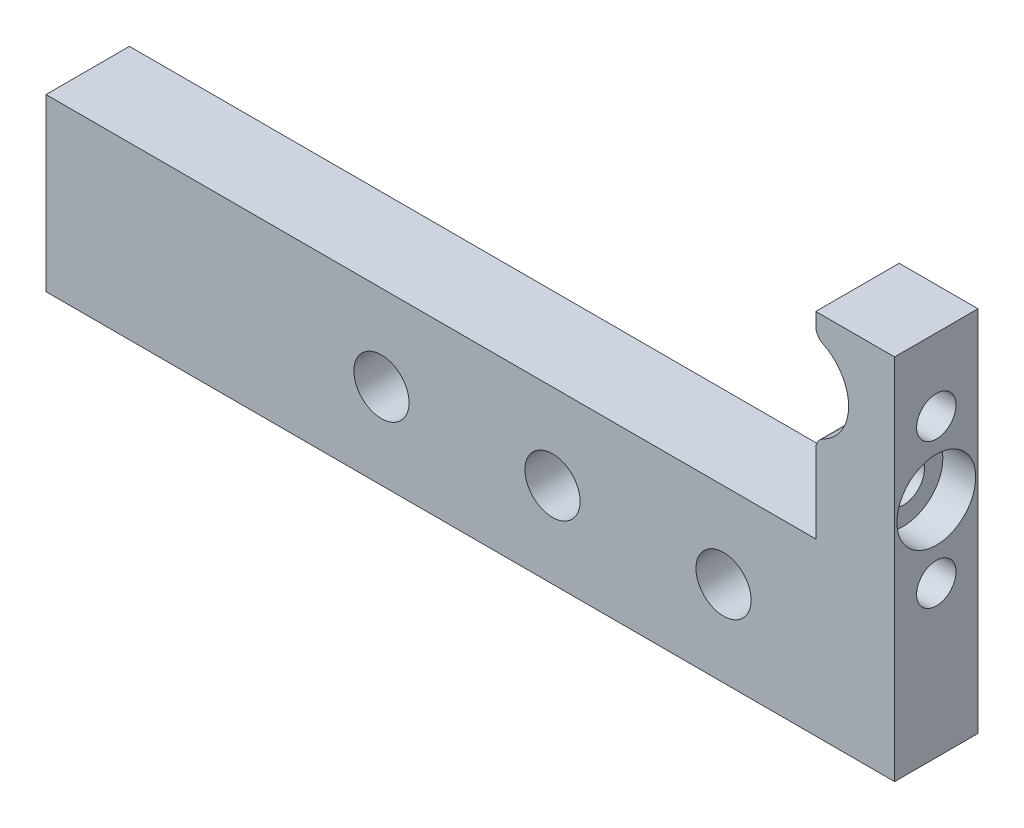
ISO-10303-21;
HEADER;
FILE_DESCRIPTION(('STEP AP214'),'2;1');
FILE_NAME('part.step','',(''),(''),'','','');
FILE_SCHEMA(('AUTOMOTIVE_DESIGN { 1 0 10303 214 1 1 1 1 }'));
ENDSEC;
DATA;
#1=APPLICATION_CONTEXT('core data for automotive mechanical design processes');
#2=APPLICATION_PROTOCOL_DEFINITION('international standard','automotive_design',2000,#1);
#3=PRODUCT_CONTEXT('',#1,'mechanical');
#4=PRODUCT('Part','Part','',(#3));
#5=PRODUCT_RELATED_PRODUCT_CATEGORY('part','',(#4));
#6=PRODUCT_DEFINITION_FORMATION('','',#4);
#7=PRODUCT_DEFINITION_CONTEXT('part definition',#1,'design');
#8=PRODUCT_DEFINITION('design','',#6,#7);
#9=PRODUCT_DEFINITION_SHAPE('','',#8);
#10=(LENGTH_UNIT() NAMED_UNIT(*) SI_UNIT(.MILLI.,.METRE.));
#11=(NAMED_UNIT(*) PLANE_ANGLE_UNIT() SI_UNIT($,.RADIAN.));
#12=(NAMED_UNIT(*) SI_UNIT($,.STERADIAN.) SOLID_ANGLE_UNIT());
#13=UNCERTAINTY_MEASURE_WITH_UNIT(LENGTH_MEASURE(1.E-05),#10,'distance_accuracy_value','');
#14=(GEOMETRIC_REPRESENTATION_CONTEXT(3) GLOBAL_UNCERTAINTY_ASSIGNED_CONTEXT((#13)) GLOBAL_UNIT_ASSIGNED_CONTEXT((#10,
#11,#12)) REPRESENTATION_CONTEXT('',''));
#15=CARTESIAN_POINT('',(0.,0.,0.));
#16=DIRECTION('',(0.,0.,1.));
#17=DIRECTION('',(1.,0.,0.));
#18=AXIS2_PLACEMENT_3D('',#15,#16,#17);
#19=CARTESIAN_POINT('',(45.4,-12.,3.17500000000004));
#20=DIRECTION('',(1.,0.,0.));
#21=DIRECTION('',(0.,0.,-1.));
#22=AXIS2_PLACEMENT_3D('',#19,#20,#21);
#23=CYLINDRICAL_SURFACE('',#22,1.6);
#24=CARTESIAN_POINT('',(104.,-12.,3.17500000000004));
#25=DIRECTION('',(1.,0.,0.));
#26=DIRECTION('',(0.,0.,-1.));
#27=AXIS2_PLACEMENT_3D('',#24,#25,#26);
#28=CIRCLE('',#27,1.6);
#29=CARTESIAN_POINT('',(104.,-12.,1.57500000000004));
#30=VERTEX_POINT('',#29);
#31=EDGE_CURVE('E142',#30,#30,#28,.T.);
#32=ORIENTED_EDGE('',*,*,#31,.F.);
#33=EDGE_LOOP('',(#32));
#34=FACE_BOUND('',#33,.T.);
#35=CARTESIAN_POINT('',(107.5,-12.,3.17500000000004));
#36=DIRECTION('',(1.,0.,0.));
#37=DIRECTION('',(0.,0.,-1.));
#38=AXIS2_PLACEMENT_3D('',#35,#36,#37);
#39=CIRCLE('',#38,1.6);
#40=CARTESIAN_POINT('',(107.5,-12.,1.57500000000004));
#41=VERTEX_POINT('',#40);
#42=EDGE_CURVE('E146',#41,#41,#39,.F.);
#43=ORIENTED_EDGE('',*,*,#42,.F.);
#44=EDGE_LOOP('',(#43));
#45=FACE_BOUND('',#44,.T.);
#46=ADVANCED_FACE('F31',(#34,#45),#23,.F.);
#47=CARTESIAN_POINT('',(103.,-5.99999999999999,6.35));
#48=DIRECTION('',(0.,0.,1.));
#49=DIRECTION('',(1.,0.,0.));
#50=AXIS2_PLACEMENT_3D('',#47,#48,#49);
#51=PLANE('',#50);
#52=CARTESIAN_POINT('',(83.9572529445862,-22.5,6.35));
#53=DIRECTION('',(0.,0.,1.));
#54=DIRECTION('',(1.,0.,0.));
#55=AXIS2_PLACEMENT_3D('',#52,#53,#54);
#56=CIRCLE('',#55,2.10000000000002);
#57=CARTESIAN_POINT('',(86.0572529445862,-22.5,6.35));
#58=VERTEX_POINT('',#57);
#59=EDGE_CURVE('E288',#58,#58,#56,.T.);
#60=ORIENTED_EDGE('',*,*,#59,.F.);
#61=EDGE_LOOP('',(#60));
#62=FACE_BOUND('',#61,.T.);
#63=DIRECTION('',(0.,-1.,0.));
#64=VECTOR('',#63,1.);
#65=CARTESIAN_POINT('',(104.,-1.,6.35));
#66=LINE('',#65,#64);
#67=CARTESIAN_POINT('',(104.,-1.,6.35));
#68=VERTEX_POINT('',#67);
#69=CARTESIAN_POINT('',(104.,-1.96887112585072,6.35));
#70=VERTEX_POINT('',#69);
#71=EDGE_CURVE('E237',#68,#70,#66,.T.);
#72=ORIENTED_EDGE('',*,*,#71,.T.);
#73=CARTESIAN_POINT('',(105.,-1.96887112585072,6.35));
#74=DIRECTION('',(0.,0.,1.));
#75=DIRECTION('',(1.,0.,0.));
#76=AXIS2_PLACEMENT_3D('',#73,#74,#75);
#77=CIRCLE('',#76,1.);
#78=CARTESIAN_POINT('',(104.555555555556,-2.86467754232833,6.35));
#79=VERTEX_POINT('',#78);
#80=EDGE_CURVE('E39',#70,#79,#77,.T.);
#81=ORIENTED_EDGE('',*,*,#80,.T.);
#82=CARTESIAN_POINT('',(103.,-5.99999999999999,6.35));
#83=DIRECTION('',(0.,0.,-1.));
#84=DIRECTION('',(1.,0.,0.));
#85=AXIS2_PLACEMENT_3D('',#82,#83,#84);
#86=CIRCLE('',#85,3.50000000000001);
#87=CARTESIAN_POINT('',(104.555555555556,-9.13532245767165,6.35));
#88=VERTEX_POINT('',#87);
#89=EDGE_CURVE('E221',#79,#88,#86,.T.);
#90=ORIENTED_EDGE('',*,*,#89,.T.);
#91=CARTESIAN_POINT('',(105.,-10.0311288741493,6.35));
#92=DIRECTION('',(0.,0.,1.));
#93=DIRECTION('',(1.,0.,0.));
#94=AXIS2_PLACEMENT_3D('',#91,#92,#93);
#95=CIRCLE('',#94,1.);
#96=CARTESIAN_POINT('',(104.,-10.0311288741493,6.35));
#97=VERTEX_POINT('',#96);
#98=EDGE_CURVE('E46',#88,#97,#95,.T.);
#99=ORIENTED_EDGE('',*,*,#98,.T.);
#100=DIRECTION('',(0.,-1.,0.));
#101=VECTOR('',#100,1.);
#102=CARTESIAN_POINT('',(104.,-9.35410196624968,6.35));
#103=LINE('',#102,#101);
#104=CARTESIAN_POINT('',(104.,-16.,6.35));
#105=VERTEX_POINT('',#104);
#106=EDGE_CURVE('E125',#97,#105,#103,.T.);
#107=ORIENTED_EDGE('',*,*,#106,.T.);
#108=DIRECTION('',(-1.,0.,0.));
#109=VECTOR('',#108,1.);
#110=CARTESIAN_POINT('',(45.4,-16.,6.35));
#111=LINE('',#110,#109);
#112=CARTESIAN_POINT('',(45.4,-16.,6.35));
#113=VERTEX_POINT('',#112);
#114=EDGE_CURVE('E120',#105,#113,#111,.T.);
#115=ORIENTED_EDGE('',*,*,#114,.T.);
#116=DIRECTION('',(0.,-1.,0.));
#117=VECTOR('',#116,1.);
#118=CARTESIAN_POINT('',(45.4,-16.,6.35));
#119=LINE('',#118,#117);
#120=CARTESIAN_POINT('',(45.4,-29.,6.35));
#121=VERTEX_POINT('',#120);
#122=EDGE_CURVE('E111',#113,#121,#119,.T.);
#123=ORIENTED_EDGE('',*,*,#122,.T.);
#124=DIRECTION('',(1.,0.,0.));
#125=VECTOR('',#124,1.);
#126=CARTESIAN_POINT('',(45.4,-29.,6.35));
#127=LINE('',#126,#125);
#128=CARTESIAN_POINT('',(110.,-29.,6.35));
#129=VERTEX_POINT('',#128);
#130=EDGE_CURVE('E119',#121,#129,#127,.T.);
#131=ORIENTED_EDGE('',*,*,#130,.T.);
#132=DIRECTION('',(0.,1.,0.));
#133=VECTOR('',#132,1.);
#134=CARTESIAN_POINT('',(110.,-29.,6.35));
#135=LINE('',#134,#133);
#136=CARTESIAN_POINT('',(110.,-1.,6.35));
#137=VERTEX_POINT('',#136);
#138=EDGE_CURVE('E271',#129,#137,#135,.T.);
#139=ORIENTED_EDGE('',*,*,#138,.T.);
#140=DIRECTION('',(-1.,0.,0.));
#141=VECTOR('',#140,1.);
#142=CARTESIAN_POINT('',(104.,-1.,6.35));
#143=LINE('',#142,#141);
#144=EDGE_CURVE('E281',#137,#68,#143,.T.);
#145=ORIENTED_EDGE('',*,*,#144,.T.);
#146=EDGE_LOOP('',(#72,#81,#90,#99,#107,#115,#123,#131,#139,#145));
#147=FACE_BOUND('',#146,.T.);
#148=CARTESIAN_POINT('',(96.9786264722931,-22.5,6.35));
#149=DIRECTION('',(0.,0.,1.));
#150=DIRECTION('',(1.,0.,0.));
#151=AXIS2_PLACEMENT_3D('',#148,#149,#150);
#152=CIRCLE('',#151,2.10000000000002);
#153=CARTESIAN_POINT('',(99.0786264722931,-22.5,6.35));
#154=VERTEX_POINT('',#153);
#155=EDGE_CURVE('E278',#154,#154,#152,.T.);
#156=ORIENTED_EDGE('',*,*,#155,.F.);
#157=EDGE_LOOP('',(#156));
#158=FACE_BOUND('',#157,.T.);
#159=CARTESIAN_POINT('',(70.9358794168792,-22.5,6.35));
#160=DIRECTION('',(0.,0.,1.));
#161=DIRECTION('',(1.,0.,0.));
#162=AXIS2_PLACEMENT_3D('',#159,#160,#161);
#163=CIRCLE('',#162,2.10000000000002);
#164=CARTESIAN_POINT('',(73.0358794168793,-22.5,6.35));
#165=VERTEX_POINT('',#164);
#166=EDGE_CURVE('E294',#165,#165,#163,.T.);
#167=ORIENTED_EDGE('',*,*,#166,.F.);
#168=EDGE_LOOP('',(#167));
#169=FACE_BOUND('',#168,.T.);
#170=ADVANCED_FACE('F123',(#62,#147,#158,#169),#51,.T.);
#171=CARTESIAN_POINT('',(103.,-5.99999999999999,0.));
#172=DIRECTION('',(0.,0.,1.));
#173=DIRECTION('',(1.,0.,0.));
#174=AXIS2_PLACEMENT_3D('',#171,#172,#173);
#175=PLANE('',#174);
#176=CARTESIAN_POINT('',(83.9572529445862,-22.5,0.));
#177=DIRECTION('',(0.,0.,1.));
#178=DIRECTION('',(1.,0.,0.));
#179=AXIS2_PLACEMENT_3D('',#176,#177,#178);
#180=CIRCLE('',#179,2.10000000000002);
#181=CARTESIAN_POINT('',(86.0572529445862,-22.5,0.));
#182=VERTEX_POINT('',#181);
#183=EDGE_CURVE('E291',#182,#182,#180,.T.);
#184=ORIENTED_EDGE('',*,*,#183,.T.);
#185=EDGE_LOOP('',(#184));
#186=FACE_BOUND('',#185,.T.);
#187=CARTESIAN_POINT('',(103.,-5.99999999999999,0.));
#188=DIRECTION('',(0.,0.,-1.));
#189=DIRECTION('',(1.,0.,0.));
#190=AXIS2_PLACEMENT_3D('',#187,#188,#189);
#191=CIRCLE('',#190,3.50000000000001);
#192=CARTESIAN_POINT('',(104.555555555556,-2.86467754232833,0.));
#193=VERTEX_POINT('',#192);
#194=CARTESIAN_POINT('',(104.555555555556,-9.13532245767165,0.));
#195=VERTEX_POINT('',#194);
#196=EDGE_CURVE('E246',#193,#195,#191,.T.);
#197=ORIENTED_EDGE('',*,*,#196,.F.);
#198=CARTESIAN_POINT('',(105.,-1.96887112585072,0.));
#199=DIRECTION('',(0.,0.,1.));
#200=DIRECTION('',(1.,0.,0.));
#201=AXIS2_PLACEMENT_3D('',#198,#199,#200);
#202=CIRCLE('',#201,1.);
#203=CARTESIAN_POINT('',(104.,-1.96887112585072,0.));
#204=VERTEX_POINT('',#203);
#205=EDGE_CURVE('E229',#193,#204,#202,.F.);
#206=ORIENTED_EDGE('',*,*,#205,.T.);
#207=DIRECTION('',(0.,-1.,0.));
#208=VECTOR('',#207,1.);
#209=CARTESIAN_POINT('',(104.,-1.,0.));
#210=LINE('',#209,#208);
#211=CARTESIAN_POINT('',(104.,-1.,0.));
#212=VERTEX_POINT('',#211);
#213=EDGE_CURVE('E245',#212,#204,#210,.T.);
#214=ORIENTED_EDGE('',*,*,#213,.F.);
#215=DIRECTION('',(-1.,0.,0.));
#216=VECTOR('',#215,1.);
#217=CARTESIAN_POINT('',(104.,-1.,0.));
#218=LINE('',#217,#216);
#219=CARTESIAN_POINT('',(110.,-1.,0.));
#220=VERTEX_POINT('',#219);
#221=EDGE_CURVE('E250',#220,#212,#218,.T.);
#222=ORIENTED_EDGE('',*,*,#221,.F.);
#223=DIRECTION('',(0.,1.,0.));
#224=VECTOR('',#223,1.);
#225=CARTESIAN_POINT('',(110.,-29.,0.));
#226=LINE('',#225,#224);
#227=CARTESIAN_POINT('',(110.,-29.,0.));
#228=VERTEX_POINT('',#227);
#229=EDGE_CURVE('E254',#228,#220,#226,.T.);
#230=ORIENTED_EDGE('',*,*,#229,.F.);
#231=DIRECTION('',(1.,0.,0.));
#232=VECTOR('',#231,1.);
#233=CARTESIAN_POINT('',(45.4,-29.,0.));
#234=LINE('',#233,#232);
#235=CARTESIAN_POINT('',(45.4,-29.,0.));
#236=VERTEX_POINT('',#235);
#237=EDGE_CURVE('E274',#236,#228,#234,.T.);
#238=ORIENTED_EDGE('',*,*,#237,.F.);
#239=DIRECTION('',(0.,-1.,0.));
#240=VECTOR('',#239,1.);
#241=CARTESIAN_POINT('',(45.4,-16.,0.));
#242=LINE('',#241,#240);
#243=CARTESIAN_POINT('',(45.4,-16.,0.));
#244=VERTEX_POINT('',#243);
#245=EDGE_CURVE('E275',#244,#236,#242,.T.);
#246=ORIENTED_EDGE('',*,*,#245,.F.);
#247=DIRECTION('',(-1.,0.,0.));
#248=VECTOR('',#247,1.);
#249=CARTESIAN_POINT('',(104.,-16.,0.));
#250=LINE('',#249,#248);
#251=CARTESIAN_POINT('',(104.,-16.,0.));
#252=VERTEX_POINT('',#251);
#253=EDGE_CURVE('E129',#252,#244,#250,.T.);
#254=ORIENTED_EDGE('',*,*,#253,.F.);
#255=DIRECTION('',(0.,-1.,0.));
#256=VECTOR('',#255,1.);
#257=CARTESIAN_POINT('',(104.,-9.35410196624968,0.));
#258=LINE('',#257,#256);
#259=CARTESIAN_POINT('',(104.,-10.0311288741493,0.));
#260=VERTEX_POINT('',#259);
#261=EDGE_CURVE('E252',#260,#252,#258,.T.);
#262=ORIENTED_EDGE('',*,*,#261,.F.);
#263=CARTESIAN_POINT('',(105.,-10.0311288741493,0.));
#264=DIRECTION('',(0.,0.,1.));
#265=DIRECTION('',(1.,0.,0.));
#266=AXIS2_PLACEMENT_3D('',#263,#264,#265);
#267=CIRCLE('',#266,1.);
#268=EDGE_CURVE('E225',#260,#195,#267,.F.);
#269=ORIENTED_EDGE('',*,*,#268,.T.);
#270=EDGE_LOOP('',(#197,#206,#214,#222,#230,#238,#246,#254,#262,#269));
#271=FACE_BOUND('',#270,.T.);
#272=CARTESIAN_POINT('',(96.9786264722931,-22.5,0.));
#273=DIRECTION('',(0.,0.,1.));
#274=DIRECTION('',(1.,0.,0.));
#275=AXIS2_PLACEMENT_3D('',#272,#273,#274);
#276=CIRCLE('',#275,2.10000000000002);
#277=CARTESIAN_POINT('',(99.0786264722931,-22.5,0.));
#278=VERTEX_POINT('',#277);
#279=EDGE_CURVE('E285',#278,#278,#276,.T.);
#280=ORIENTED_EDGE('',*,*,#279,.T.);
#281=EDGE_LOOP('',(#280));
#282=FACE_BOUND('',#281,.T.);
#283=CARTESIAN_POINT('',(70.9358794168792,-22.5,0.));
#284=DIRECTION('',(0.,0.,1.));
#285=DIRECTION('',(1.,0.,0.));
#286=AXIS2_PLACEMENT_3D('',#283,#284,#285);
#287=CIRCLE('',#286,2.10000000000002);
#288=CARTESIAN_POINT('',(73.0358794168793,-22.5,0.));
#289=VERTEX_POINT('',#288);
#290=EDGE_CURVE('E145',#289,#289,#287,.T.);
#291=ORIENTED_EDGE('',*,*,#290,.T.);
#292=EDGE_LOOP('',(#291));
#293=FACE_BOUND('',#292,.T.);
#294=ADVANCED_FACE('F202',(#186,#271,#282,#293),#175,.F.);
#295=CARTESIAN_POINT('',(45.4,-16.,6.35));
#296=DIRECTION('',(1.,0.,0.));
#297=DIRECTION('',(0.,1.,0.));
#298=AXIS2_PLACEMENT_3D('',#295,#296,#297);
#299=PLANE('',#298);
#300=ORIENTED_EDGE('',*,*,#245,.T.);
#301=DIRECTION('',(0.,0.,-1.));
#302=VECTOR('',#301,1.);
#303=CARTESIAN_POINT('',(45.4,-29.,6.35));
#304=LINE('',#303,#302);
#305=EDGE_CURVE('E117',#121,#236,#304,.T.);
#306=ORIENTED_EDGE('',*,*,#305,.F.);
#307=ORIENTED_EDGE('',*,*,#122,.F.);
#308=DIRECTION('',(0.,0.,-1.));
#309=VECTOR('',#308,1.);
#310=CARTESIAN_POINT('',(45.4,-16.,6.35));
#311=LINE('',#310,#309);
#312=EDGE_CURVE('E115',#113,#244,#311,.T.);
#313=ORIENTED_EDGE('',*,*,#312,.T.);
#314=EDGE_LOOP('',(#300,#306,#307,#313));
#315=FACE_BOUND('',#314,.T.);
#316=ADVANCED_FACE('F113',(#315),#299,.F.);
#317=CARTESIAN_POINT('',(45.4,-29.,6.35));
#318=DIRECTION('',(0.,1.,0.));
#319=DIRECTION('',(-1.,0.,0.));
#320=AXIS2_PLACEMENT_3D('',#317,#318,#319);
#321=PLANE('',#320);
#322=ORIENTED_EDGE('',*,*,#237,.T.);
#323=DIRECTION('',(0.,0.,-1.));
#324=VECTOR('',#323,1.);
#325=CARTESIAN_POINT('',(110.,-29.,6.35));
#326=LINE('',#325,#324);
#327=EDGE_CURVE('E138',#129,#228,#326,.T.);
#328=ORIENTED_EDGE('',*,*,#327,.F.);
#329=ORIENTED_EDGE('',*,*,#130,.F.);
#330=ORIENTED_EDGE('',*,*,#305,.T.);
#331=EDGE_LOOP('',(#322,#328,#329,#330));
#332=FACE_BOUND('',#331,.T.);
#333=ADVANCED_FACE('F318',(#332),#321,.F.);
#334=CARTESIAN_POINT('',(110.,-29.,6.35));
#335=DIRECTION('',(-1.,0.,0.));
#336=DIRECTION('',(0.,0.,1.));
#337=AXIS2_PLACEMENT_3D('',#334,#335,#336);
#338=PLANE('',#337);
#339=CARTESIAN_POINT('',(110.,-6.50000000000003,3.17500000000004));
#340=DIRECTION('',(1.,0.,0.));
#341=DIRECTION('',(0.,0.,-1.));
#342=AXIS2_PLACEMENT_3D('',#339,#340,#341);
#343=CIRCLE('',#342,1.5);
#344=CARTESIAN_POINT('',(110.,-6.50000000000003,1.67500000000004));
#345=VERTEX_POINT('',#344);
#346=EDGE_CURVE('E157',#345,#345,#343,.T.);
#347=ORIENTED_EDGE('',*,*,#346,.F.);
#348=EDGE_LOOP('',(#347));
#349=FACE_BOUND('',#348,.T.);
#350=CARTESIAN_POINT('',(110.,-17.5,3.17500000000004));
#351=DIRECTION('',(1.,0.,0.));
#352=DIRECTION('',(0.,0.,-1.));
#353=AXIS2_PLACEMENT_3D('',#350,#351,#352);
#354=CIRCLE('',#353,1.5);
#355=CARTESIAN_POINT('',(110.,-17.5,1.67500000000004));
#356=VERTEX_POINT('',#355);
#357=EDGE_CURVE('E156',#356,#356,#354,.T.);
#358=ORIENTED_EDGE('',*,*,#357,.F.);
#359=EDGE_LOOP('',(#358));
#360=FACE_BOUND('',#359,.T.);
#361=CARTESIAN_POINT('',(110.,-12.,3.17500000000004));
#362=DIRECTION('',(1.,0.,0.));
#363=DIRECTION('',(0.,0.,-1.));
#364=AXIS2_PLACEMENT_3D('',#361,#362,#363);
#365=CIRCLE('',#364,3.);
#366=CARTESIAN_POINT('',(110.,-12.,0.175000000000038));
#367=VERTEX_POINT('',#366);
#368=EDGE_CURVE('E301',#367,#367,#365,.T.);
#369=ORIENTED_EDGE('',*,*,#368,.F.);
#370=EDGE_LOOP('',(#369));
#371=FACE_BOUND('',#370,.T.);
#372=ORIENTED_EDGE('',*,*,#229,.T.);
#373=DIRECTION('',(0.,0.,-1.));
#374=VECTOR('',#373,1.);
#375=CARTESIAN_POINT('',(110.,-1.,6.35));
#376=LINE('',#375,#374);
#377=EDGE_CURVE('E262',#137,#220,#376,.T.);
#378=ORIENTED_EDGE('',*,*,#377,.F.);
#379=ORIENTED_EDGE('',*,*,#138,.F.);
#380=ORIENTED_EDGE('',*,*,#327,.T.);
#381=EDGE_LOOP('',(#372,#378,#379,#380));
#382=FACE_BOUND('',#381,.T.);
#383=ADVANCED_FACE('F269',(#349,#360,#371,#382),#338,.F.);
#384=CARTESIAN_POINT('',(104.,-1.,6.35));
#385=DIRECTION('',(0.,-1.,0.));
#386=DIRECTION('',(0.,0.,-1.));
#387=AXIS2_PLACEMENT_3D('',#384,#385,#386);
#388=PLANE('',#387);
#389=ORIENTED_EDGE('',*,*,#221,.T.);
#390=DIRECTION('',(0.,0.,-1.));
#391=VECTOR('',#390,1.);
#392=CARTESIAN_POINT('',(104.,-1.,6.35));
#393=LINE('',#392,#391);
#394=EDGE_CURVE('E249',#68,#212,#393,.T.);
#395=ORIENTED_EDGE('',*,*,#394,.F.);
#396=ORIENTED_EDGE('',*,*,#144,.F.);
#397=ORIENTED_EDGE('',*,*,#377,.T.);
#398=EDGE_LOOP('',(#389,#395,#396,#397));
#399=FACE_BOUND('',#398,.T.);
#400=ADVANCED_FACE('F317',(#399),#388,.F.);
#401=CARTESIAN_POINT('',(104.,-1.,6.35));
#402=DIRECTION('',(1.,0.,0.));
#403=DIRECTION('',(0.,0.,-1.));
#404=AXIS2_PLACEMENT_3D('',#401,#402,#403);
#405=PLANE('',#404);
#406=ORIENTED_EDGE('',*,*,#213,.T.);
#407=DIRECTION('',(0.,0.,-1.));
#408=VECTOR('',#407,1.);
#409=CARTESIAN_POINT('',(104.,-1.96887112585072,6.35));
#410=LINE('',#409,#408);
#411=EDGE_CURVE('E54',#204,#70,#410,.F.);
#412=ORIENTED_EDGE('',*,*,#411,.T.);
#413=ORIENTED_EDGE('',*,*,#71,.F.);
#414=ORIENTED_EDGE('',*,*,#394,.T.);
#415=EDGE_LOOP('',(#406,#412,#413,#414));
#416=FACE_BOUND('',#415,.T.);
#417=ADVANCED_FACE('F214',(#416),#405,.F.);
#418=CARTESIAN_POINT('',(103.,-5.99999999999999,6.35));
#419=DIRECTION('',(0.,0.,-1.));
#420=DIRECTION('',(-1.,0.,0.));
#421=AXIS2_PLACEMENT_3D('',#418,#419,#420);
#422=CYLINDRICAL_SURFACE('',#421,3.50000000000001);
#423=CARTESIAN_POINT('',(106.464101615138,-6.50000000000003,1.67500000000004));
#424=CARTESIAN_POINT('',(106.475351789507,-6.42203163953584,1.67500442399997));
#425=CARTESIAN_POINT('',(106.483960698333,-6.34361066464195,1.68110797623919));
#426=CARTESIAN_POINT('',(106.49580507365,-6.18824439791959,1.70564374821259));
#427=CARTESIAN_POINT('',(106.499034299432,-6.11130092215626,1.72409025169792));
#428=CARTESIAN_POINT('',(106.500588724377,-5.9613457023056,1.77283846741956));
#429=CARTESIAN_POINT('',(106.498921095822,-5.88832836729727,1.80312278480571));
#430=CARTESIAN_POINT('',(106.491632074619,-5.74812470055011,1.87466095076449));
#431=CARTESIAN_POINT('',(106.486010653438,-5.68093841089616,1.91591487850025));
#432=CARTESIAN_POINT('',(106.471907465461,-5.5526559799953,2.00925231389555));
#433=CARTESIAN_POINT('',(106.463366360802,-5.49172334131479,2.06155110518755));
#434=CARTESIAN_POINT('',(106.444950582233,-5.37904815248939,2.17506630497793));
#435=CARTESIAN_POINT('',(106.435075481468,-5.32730855626905,2.23628556835883));
#436=CARTESIAN_POINT('',(106.41500277516,-5.23170742065451,2.36969176712607));
#437=CARTESIAN_POINT('',(106.40481624687,-5.18841665848731,2.4422906457822));
#438=CARTESIAN_POINT('',(106.386361081826,-5.1145534383478,2.59392485832169));
#439=CARTESIAN_POINT('',(106.378092326914,-5.08398019672778,2.67295979525915));
#440=CARTESIAN_POINT('',(106.364879917679,-5.03657167075351,2.83515036827173));
#441=CARTESIAN_POINT('',(106.359929287564,-5.01970754930664,2.91829696234376));
#442=CARTESIAN_POINT('',(106.354187845891,-5.00023408908483,3.08637397189814));
#443=CARTESIAN_POINT('',(106.35339582694,-4.99762061283708,3.17130386243606));
#444=CARTESIAN_POINT('',(106.356053374539,-5.00656079328712,3.33706656548875));
#445=CARTESIAN_POINT('',(106.359341704986,-5.01757586560268,3.41793174484971));
#446=CARTESIAN_POINT('',(106.36935206165,-5.05248107436314,3.57660969325911));
#447=CARTESIAN_POINT('',(106.37607448825,-5.07637271211611,3.65442210524334));
#448=CARTESIAN_POINT('',(106.391952896548,-5.13650522258937,3.80551076796083));
#449=CARTESIAN_POINT('',(106.401126493645,-5.17283604395372,3.87874925048498));
#450=CARTESIAN_POINT('',(106.420457999905,-5.25681845423218,4.01828791871969));
#451=CARTESIAN_POINT('',(106.430616171165,-5.30447306249725,4.08458624711854));
#452=CARTESIAN_POINT('',(106.45070171554,-5.41198966213606,4.21104146616473));
#453=CARTESIAN_POINT('',(106.460605120793,-5.47225121390631,4.2708633611805));
#454=CARTESIAN_POINT('',(106.477938518519,-5.60221533565046,4.37964113388111));
#455=CARTESIAN_POINT('',(106.485368754053,-5.67191697691764,4.42859807920048));
#456=CARTESIAN_POINT('',(106.496016617706,-5.81792682615717,4.51358815878952));
#457=CARTESIAN_POINT('',(106.4992864726,-5.89414004448778,4.5497773117206));
#458=CARTESIAN_POINT('',(106.500503097872,-6.0515830005276,4.60887006896856));
#459=CARTESIAN_POINT('',(106.498452404906,-6.13281032965255,4.63177999799781));
#460=CARTESIAN_POINT('',(106.488590610388,-6.29292557688367,4.6627475818383));
#461=CARTESIAN_POINT('',(106.481110921215,-6.37168705442324,4.67157003377651));
#462=CARTESIAN_POINT('',(106.460714168693,-6.52890409654936,4.67678249406023));
#463=CARTESIAN_POINT('',(106.447797248973,-6.60735966916141,4.67317283079279));
#464=CARTESIAN_POINT('',(106.417138617377,-6.76109052141801,4.65411533967038));
#465=CARTESIAN_POINT('',(106.399440376897,-6.83638771664883,4.63877199767477));
#466=CARTESIAN_POINT('',(106.360038832189,-6.98279914168798,4.59721706915249));
#467=CARTESIAN_POINT('',(106.338334600932,-7.05391239825458,4.57100296526097));
#468=CARTESIAN_POINT('',(106.290312773195,-7.19576831145642,4.50632726268804));
#469=CARTESIAN_POINT('',(106.263771144488,-7.26608221509391,4.46709384417909));
#470=CARTESIAN_POINT('',(106.208978563767,-7.39915909325202,4.37829618502259));
#471=CARTESIAN_POINT('',(106.180726187459,-7.46191564225693,4.32872324983707));
#472=CARTESIAN_POINT('',(106.121550078107,-7.58461587336127,4.21485176249638));
#473=CARTESIAN_POINT('',(106.090638440429,-7.64366778833063,4.14958181427433));
#474=CARTESIAN_POINT('',(106.031721198218,-7.74996042601031,4.00888272357512));
#475=CARTESIAN_POINT('',(106.003713860649,-7.79720821640503,3.93345970205426));
#476=CARTESIAN_POINT('',(105.958202429765,-7.87098242991897,3.78804045712837));
#477=CARTESIAN_POINT('',(105.939716202677,-7.89969982559528,3.71946559931884));
#478=CARTESIAN_POINT('',(105.908685060209,-7.94688341842851,3.5776161618564));
#479=CARTESIAN_POINT('',(105.896133591808,-7.96536092612708,3.5043468677146));
#480=CARTESIAN_POINT('',(105.87845686459,-7.99116598257805,3.35452320542471));
#481=CARTESIAN_POINT('',(105.873373660112,-7.99843040111458,3.27795271450947));
#482=CARTESIAN_POINT('',(105.871508296015,-8.00111098627611,3.12450170844003));
#483=CARTESIAN_POINT('',(105.874724903368,-7.99652891282953,3.04762124103049));
#484=CARTESIAN_POINT('',(105.888324910297,-7.97678967010049,2.90310138675453));
#485=CARTESIAN_POINT('',(105.898032342559,-7.9626285879611,2.83525597364569));
#486=CARTESIAN_POINT('',(105.92284234583,-7.92548378948267,2.70307482167358));
#487=CARTESIAN_POINT('',(105.937946782761,-7.90249702160805,2.63874030552172));
#488=CARTESIAN_POINT('',(105.973507643708,-7.84646440834381,2.50991103391751));
#489=CARTESIAN_POINT('',(105.994286605586,-7.81278032609356,2.44578534415808));
#490=CARTESIAN_POINT('',(106.038791171692,-7.73714538205303,2.32374672225245));
#491=CARTESIAN_POINT('',(106.062518258233,-7.69519035537377,2.26583694295364));
#492=CARTESIAN_POINT('',(106.115446743153,-7.59613499302897,2.14767885736426));
#493=CARTESIAN_POINT('',(106.144897251222,-7.53767401251524,2.08867828810842));
#494=CARTESIAN_POINT('',(106.203434173717,-7.41167983983796,1.98096657173595));
#495=CARTESIAN_POINT('',(106.23252019526,-7.34413764791522,1.93226575678208));
#496=CARTESIAN_POINT('',(106.290441419513,-7.19574522733452,1.84308852473784));
#497=CARTESIAN_POINT('',(106.319090267153,-7.11427417453053,1.80351608842781));
#498=CARTESIAN_POINT('',(106.37138908567,-6.9442413772578,1.73943118361252));
#499=CARTESIAN_POINT('',(106.395051568182,-6.85569816771337,1.71488072017584));
#500=CARTESIAN_POINT('',(106.425094073781,-6.72161532236164,1.69080322484776));
#501=CARTESIAN_POINT('',(106.434053538331,-6.67771678157243,1.68490312136322));
#502=CARTESIAN_POINT('',(106.450332075821,-6.58926179579649,1.67700008646655));
#503=CARTESIAN_POINT('',(106.457651018942,-6.54470529904077,1.67499746337828));
#504=CARTESIAN_POINT('',(106.464101615138,-6.50000000000003,1.67500000000004));
#505=B_SPLINE_CURVE_WITH_KNOTS('',3,(#423,#424,#425,#426,#427,#428,#429,#430,#431,#432,#433,
#434,#435,#436,#437,#438,#439,#440,#441,#442,#443,#444,#445,#446,#447,#448,#449,#450,#451,#452,
#453,#454,#455,#456,#457,#458,#459,#460,#461,#462,#463,#464,#465,#466,#467,#468,#469,#470,#471,
#472,#473,#474,#475,#476,#477,#478,#479,#480,#481,#482,#483,#484,#485,#486,#487,#488,#489,#490,
#491,#492,#493,#494,#495,#496,#497,#498,#499,#500,#501,#502,#503,#504),.UNSPECIFIED.,.T.,.F.,(4,
2,2,2,2,2,2,2,2,2,2,2,2,2,2,2,2,2,2,2,2,2,2,2,2,2,2,2,2,2,2,2,2,2,2,2,2,2,2,2,4),(0.,
0.236158345086573,0.472590455693181,0.708676443820733,0.944764135729006,1.18596730016782,
1.42724782881979,1.68145861391372,1.93565373233587,2.1893127583549,2.44289813414874,
2.68677451492363,2.93067933595387,3.17638646254829,3.42215917763979,3.67740025117075,
3.93261623255068,4.18459572241087,4.43645509906671,4.67410951595479,4.91175765538897,
5.1473138826111,5.38292468856439,5.63622648595886,5.88974215080087,6.16832617905535,
6.44674300403139,6.67563241151205,6.90426849106878,7.13418716709745,7.36407168810695,
7.57312117058416,7.78224299840229,8.00746645116633,8.23280360773058,8.49607844335982,
8.75961614249575,9.04314273010306,9.32594919989116,9.46134635695333,9.59675422464746),.UNSPECIFIED.);
#506=CARTESIAN_POINT('',(106.464101615138,-6.50000000000003,1.67500000000004));
#507=VERTEX_POINT('',#506);
#508=EDGE_CURVE('E150',#507,#507,#505,.T.);
#509=ORIENTED_EDGE('',*,*,#508,.T.);
#510=EDGE_LOOP('',(#509));
#511=FACE_BOUND('',#510,.T.);
#512=ORIENTED_EDGE('',*,*,#89,.F.);
#513=DIRECTION('',(0.,0.,-1.));
#514=VECTOR('',#513,1.);
#515=CARTESIAN_POINT('',(104.555555555556,-2.86467754232833,6.35));
#516=LINE('',#515,#514);
#517=EDGE_CURVE('E136',#79,#193,#516,.T.);
#518=ORIENTED_EDGE('',*,*,#517,.T.);
#519=ORIENTED_EDGE('',*,*,#196,.T.);
#520=DIRECTION('',(0.,0.,-1.));
#521=VECTOR('',#520,1.);
#522=CARTESIAN_POINT('',(104.555555555556,-9.13532245767165,6.35));
#523=LINE('',#522,#521);
#524=EDGE_CURVE('E134',#195,#88,#523,.F.);
#525=ORIENTED_EDGE('',*,*,#524,.T.);
#526=EDGE_LOOP('',(#512,#518,#519,#525));
#527=FACE_BOUND('',#526,.T.);
#528=ADVANCED_FACE('F159',(#511,#527),#422,.F.);
#529=CARTESIAN_POINT('',(104.,-9.35410196624968,6.35));
#530=DIRECTION('',(1.,0.,0.));
#531=DIRECTION('',(0.,0.,-1.));
#532=AXIS2_PLACEMENT_3D('',#529,#530,#531);
#533=PLANE('',#532);
#534=ORIENTED_EDGE('',*,*,#31,.T.);
#535=EDGE_LOOP('',(#534));
#536=FACE_BOUND('',#535,.T.);
#537=ORIENTED_EDGE('',*,*,#106,.F.);
#538=DIRECTION('',(0.,0.,-1.));
#539=VECTOR('',#538,1.);
#540=CARTESIAN_POINT('',(104.,-10.0311288741493,6.35));
#541=LINE('',#540,#539);
#542=EDGE_CURVE('E11',#97,#260,#541,.T.);
#543=ORIENTED_EDGE('',*,*,#542,.T.);
#544=ORIENTED_EDGE('',*,*,#261,.T.);
#545=DIRECTION('',(0.,0.,-1.));
#546=VECTOR('',#545,1.);
#547=CARTESIAN_POINT('',(104.,-16.,6.35));
#548=LINE('',#547,#546);
#549=EDGE_CURVE('E220',#105,#252,#548,.T.);
#550=ORIENTED_EDGE('',*,*,#549,.F.);
#551=EDGE_LOOP('',(#537,#543,#544,#550));
#552=FACE_BOUND('',#551,.T.);
#553=ADVANCED_FACE('F208',(#536,#552),#533,.F.);
#554=CARTESIAN_POINT('',(104.,-16.,6.35));
#555=DIRECTION('',(0.,-1.,0.));
#556=DIRECTION('',(0.,0.,-1.));
#557=AXIS2_PLACEMENT_3D('',#554,#555,#556);
#558=PLANE('',#557);
#559=ORIENTED_EDGE('',*,*,#253,.T.);
#560=ORIENTED_EDGE('',*,*,#312,.F.);
#561=ORIENTED_EDGE('',*,*,#114,.F.);
#562=ORIENTED_EDGE('',*,*,#549,.T.);
#563=EDGE_LOOP('',(#559,#560,#561,#562));
#564=FACE_BOUND('',#563,.T.);
#565=ADVANCED_FACE('F131',(#564),#558,.F.);
#566=CARTESIAN_POINT('',(96.9786264722931,-22.5,6.35));
#567=DIRECTION('',(0.,0.,-1.));
#568=DIRECTION('',(-1.,0.,0.));
#569=AXIS2_PLACEMENT_3D('',#566,#567,#568);
#570=CYLINDRICAL_SURFACE('',#569,2.10000000000002);
#571=ORIENTED_EDGE('',*,*,#155,.T.);
#572=EDGE_LOOP('',(#571));
#573=FACE_BOUND('',#572,.T.);
#574=ORIENTED_EDGE('',*,*,#279,.F.);
#575=EDGE_LOOP('',(#574));
#576=FACE_BOUND('',#575,.T.);
#577=ADVANCED_FACE('F195',(#573,#576),#570,.F.);
#578=CARTESIAN_POINT('',(83.9572529445862,-22.5,6.35));
#579=DIRECTION('',(0.,0.,-1.));
#580=DIRECTION('',(-1.,0.,0.));
#581=AXIS2_PLACEMENT_3D('',#578,#579,#580);
#582=CYLINDRICAL_SURFACE('',#581,2.10000000000002);
#583=ORIENTED_EDGE('',*,*,#59,.T.);
#584=EDGE_LOOP('',(#583));
#585=FACE_BOUND('',#584,.T.);
#586=ORIENTED_EDGE('',*,*,#183,.F.);
#587=EDGE_LOOP('',(#586));
#588=FACE_BOUND('',#587,.T.);
#589=ADVANCED_FACE('F191',(#585,#588),#582,.F.);
#590=CARTESIAN_POINT('',(70.9358794168792,-22.5,6.35));
#591=DIRECTION('',(0.,0.,-1.));
#592=DIRECTION('',(-1.,0.,0.));
#593=AXIS2_PLACEMENT_3D('',#590,#591,#592);
#594=CYLINDRICAL_SURFACE('',#593,2.10000000000002);
#595=ORIENTED_EDGE('',*,*,#166,.T.);
#596=EDGE_LOOP('',(#595));
#597=FACE_BOUND('',#596,.T.);
#598=ORIENTED_EDGE('',*,*,#290,.F.);
#599=EDGE_LOOP('',(#598));
#600=FACE_BOUND('',#599,.T.);
#601=ADVANCED_FACE('F181',(#597,#600),#594,.F.);
#602=CARTESIAN_POINT('',(107.5,-12.,3.17500000000004));
#603=DIRECTION('',(1.,0.,0.));
#604=DIRECTION('',(0.,0.,-1.));
#605=AXIS2_PLACEMENT_3D('',#602,#603,#604);
#606=PLANE('',#605);
#607=CARTESIAN_POINT('',(107.5,-12.,3.17500000000004));
#608=DIRECTION('',(1.,0.,0.));
#609=DIRECTION('',(0.,0.,-1.));
#610=AXIS2_PLACEMENT_3D('',#607,#608,#609);
#611=CIRCLE('',#610,3.);
#612=CARTESIAN_POINT('',(107.5,-12.,0.175000000000038));
#613=VERTEX_POINT('',#612);
#614=EDGE_CURVE('E149',#613,#613,#611,.T.);
#615=ORIENTED_EDGE('',*,*,#614,.T.);
#616=EDGE_LOOP('',(#615));
#617=FACE_BOUND('',#616,.T.);
#618=ORIENTED_EDGE('',*,*,#42,.T.);
#619=EDGE_LOOP('',(#618));
#620=FACE_BOUND('',#619,.T.);
#621=ADVANCED_FACE('F178',(#617,#620),#606,.T.);
#622=CARTESIAN_POINT('',(107.5,-12.,3.17500000000004));
#623=DIRECTION('',(1.,0.,0.));
#624=DIRECTION('',(0.,0.,-1.));
#625=AXIS2_PLACEMENT_3D('',#622,#623,#624);
#626=CYLINDRICAL_SURFACE('',#625,3.);
#627=ORIENTED_EDGE('',*,*,#614,.F.);
#628=EDGE_LOOP('',(#627));
#629=FACE_BOUND('',#628,.T.);
#630=ORIENTED_EDGE('',*,*,#368,.T.);
#631=EDGE_LOOP('',(#630));
#632=FACE_BOUND('',#631,.T.);
#633=ADVANCED_FACE('F176',(#629,#632),#626,.F.);
#634=CARTESIAN_POINT('',(105.,-17.5,3.17500000000004));
#635=DIRECTION('',(1.,0.,0.));
#636=DIRECTION('',(0.,0.,-1.));
#637=AXIS2_PLACEMENT_3D('',#634,#635,#636);
#638=CYLINDRICAL_SURFACE('',#637,1.5);
#639=CARTESIAN_POINT('',(105.,-17.5,3.17500000000004));
#640=DIRECTION('',(1.,0.,0.));
#641=DIRECTION('',(0.,0.,-1.));
#642=AXIS2_PLACEMENT_3D('',#639,#640,#641);
#643=CIRCLE('',#642,1.5);
#644=CARTESIAN_POINT('',(105.,-17.5,1.67500000000004));
#645=VERTEX_POINT('',#644);
#646=EDGE_CURVE('E304',#645,#645,#643,.T.);
#647=ORIENTED_EDGE('',*,*,#646,.F.);
#648=EDGE_LOOP('',(#647));
#649=FACE_BOUND('',#648,.T.);
#650=ORIENTED_EDGE('',*,*,#357,.T.);
#651=EDGE_LOOP('',(#650));
#652=FACE_BOUND('',#651,.T.);
#653=ADVANCED_FACE('F172',(#649,#652),#638,.F.);
#654=CARTESIAN_POINT('',(105.,-17.5,3.17500000000004));
#655=DIRECTION('',(1.,0.,0.));
#656=DIRECTION('',(0.,0.,-1.));
#657=AXIS2_PLACEMENT_3D('',#654,#655,#656);
#658=PLANE('',#657);
#659=ORIENTED_EDGE('',*,*,#646,.T.);
#660=EDGE_LOOP('',(#659));
#661=FACE_BOUND('',#660,.T.);
#662=ADVANCED_FACE('F168',(#661),#658,.T.);
#663=CARTESIAN_POINT('',(105.,-6.50000000000003,3.17500000000004));
#664=DIRECTION('',(1.,0.,0.));
#665=DIRECTION('',(0.,0.,-1.));
#666=AXIS2_PLACEMENT_3D('',#663,#664,#665);
#667=CYLINDRICAL_SURFACE('',#666,1.5);
#668=ORIENTED_EDGE('',*,*,#346,.T.);
#669=EDGE_LOOP('',(#668));
#670=FACE_BOUND('',#669,.T.);
#671=ORIENTED_EDGE('',*,*,#508,.F.);
#672=EDGE_LOOP('',(#671));
#673=FACE_BOUND('',#672,.T.);
#674=ADVANCED_FACE('F163',(#670,#673),#667,.F.);
#675=CARTESIAN_POINT('',(105.,-1.96887112585072,6.35));
#676=DIRECTION('',(0.,0.,-1.));
#677=DIRECTION('',(-1.,0.,0.));
#678=AXIS2_PLACEMENT_3D('',#675,#676,#677);
#679=CYLINDRICAL_SURFACE('',#678,1.);
#680=ORIENTED_EDGE('',*,*,#80,.F.);
#681=ORIENTED_EDGE('',*,*,#411,.F.);
#682=ORIENTED_EDGE('',*,*,#205,.F.);
#683=ORIENTED_EDGE('',*,*,#517,.F.);
#684=EDGE_LOOP('',(#680,#681,#682,#683));
#685=FACE_BOUND('',#684,.T.);
#686=ADVANCED_FACE('F167',(#685),#679,.T.);
#687=CARTESIAN_POINT('',(105.,-10.0311288741493,6.35));
#688=DIRECTION('',(0.,0.,-1.));
#689=DIRECTION('',(-1.,0.,0.));
#690=AXIS2_PLACEMENT_3D('',#687,#688,#689);
#691=CYLINDRICAL_SURFACE('',#690,1.);
#692=ORIENTED_EDGE('',*,*,#98,.F.);
#693=ORIENTED_EDGE('',*,*,#524,.F.);
#694=ORIENTED_EDGE('',*,*,#268,.F.);
#695=ORIENTED_EDGE('',*,*,#542,.F.);
#696=EDGE_LOOP('',(#692,#693,#694,#695));
#697=FACE_BOUND('',#696,.T.);
#698=ADVANCED_FACE('F33',(#697),#691,.T.);
#699=CLOSED_SHELL('',(#46,#170,#294,#316,#333,#383,#400,#417,#528,#553,#565,#577,#589,#601,#621,
#633,#653,#662,#674,#686,#698));
#700=MANIFOLD_SOLID_BREP('B2',#699);
#701=ADVANCED_BREP_SHAPE_REPRESENTATION('',(#18,#700),#14);
#702=SHAPE_DEFINITION_REPRESENTATION(#9,#701);
ENDSEC;
END-ISO-10303-21;
